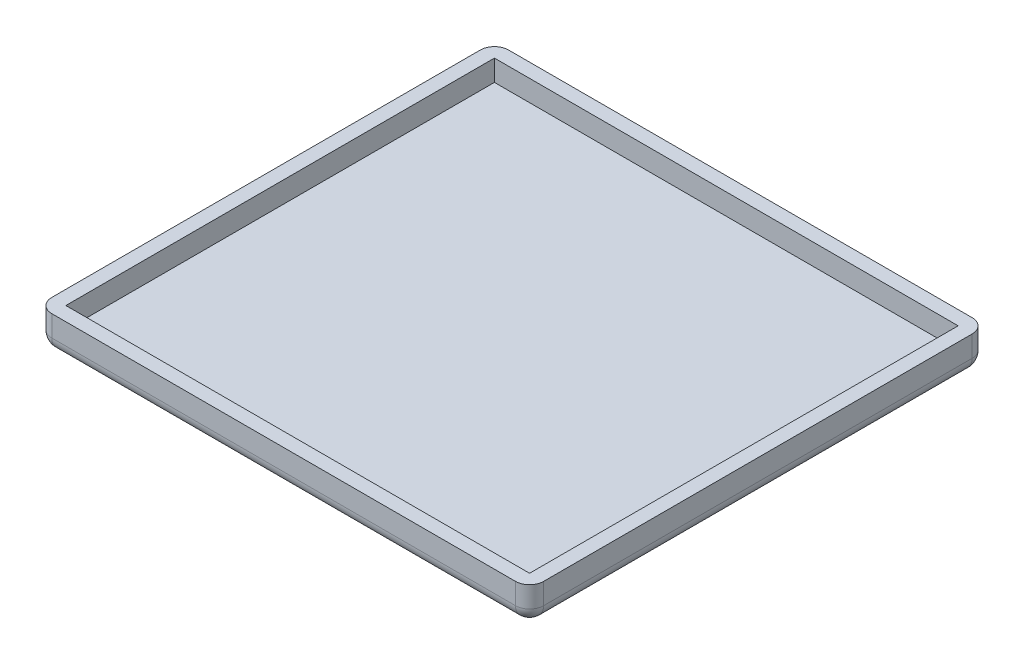
ISO-10303-21;
HEADER;
FILE_DESCRIPTION(('STEP AP214'),'2;1');
FILE_NAME('part.step','',(''),(''),'','','');
FILE_SCHEMA(('AUTOMOTIVE_DESIGN { 1 0 10303 214 1 1 1 1 }'));
ENDSEC;
DATA;
#1=APPLICATION_CONTEXT('core data for automotive mechanical design processes');
#2=APPLICATION_PROTOCOL_DEFINITION('international standard','automotive_design',2000,#1);
#3=PRODUCT_CONTEXT('',#1,'mechanical');
#4=PRODUCT('Part','Part','',(#3));
#5=PRODUCT_RELATED_PRODUCT_CATEGORY('part','',(#4));
#6=PRODUCT_DEFINITION_FORMATION('','',#4);
#7=PRODUCT_DEFINITION_CONTEXT('part definition',#1,'design');
#8=PRODUCT_DEFINITION('design','',#6,#7);
#9=PRODUCT_DEFINITION_SHAPE('','',#8);
#10=(LENGTH_UNIT() NAMED_UNIT(*) SI_UNIT(.MILLI.,.METRE.));
#11=(NAMED_UNIT(*) PLANE_ANGLE_UNIT() SI_UNIT($,.RADIAN.));
#12=(NAMED_UNIT(*) SI_UNIT($,.STERADIAN.) SOLID_ANGLE_UNIT());
#13=UNCERTAINTY_MEASURE_WITH_UNIT(LENGTH_MEASURE(1.E-05),#10,'distance_accuracy_value','');
#14=(GEOMETRIC_REPRESENTATION_CONTEXT(3) GLOBAL_UNCERTAINTY_ASSIGNED_CONTEXT((#13)) GLOBAL_UNIT_ASSIGNED_CONTEXT((#10,
#11,#12)) REPRESENTATION_CONTEXT('',''));
#15=CARTESIAN_POINT('',(0.,0.,0.));
#16=DIRECTION('',(0.,0.,1.));
#17=DIRECTION('',(1.,0.,0.));
#18=AXIS2_PLACEMENT_3D('',#15,#16,#17);
#19=CARTESIAN_POINT('',(-33.,5.,-30.5));
#20=DIRECTION('',(1.,0.,0.));
#21=DIRECTION('',(0.,0.,-1.));
#22=AXIS2_PLACEMENT_3D('',#19,#20,#21);
#23=PLANE('',#22);
#24=DIRECTION('',(0.,-1.,0.));
#25=VECTOR('',#24,1.);
#26=CARTESIAN_POINT('',(-33.,5.,30.5));
#27=LINE('',#26,#25);
#28=CARTESIAN_POINT('',(-33.,5.,30.5));
#29=VERTEX_POINT('',#28);
#30=CARTESIAN_POINT('',(-33.,2.,30.5));
#31=VERTEX_POINT('',#30);
#32=EDGE_CURVE('E156',#29,#31,#27,.T.);
#33=ORIENTED_EDGE('',*,*,#32,.T.);
#34=DIRECTION('',(0.,0.,1.));
#35=VECTOR('',#34,1.);
#36=CARTESIAN_POINT('',(-33.,2.,30.5));
#37=LINE('',#36,#35);
#38=CARTESIAN_POINT('',(-33.,2.,-30.5));
#39=VERTEX_POINT('',#38);
#40=EDGE_CURVE('E139',#39,#31,#37,.T.);
#41=ORIENTED_EDGE('',*,*,#40,.F.);
#42=DIRECTION('',(0.,-1.,0.));
#43=VECTOR('',#42,1.);
#44=CARTESIAN_POINT('',(-33.,5.,-30.5));
#45=LINE('',#44,#43);
#46=CARTESIAN_POINT('',(-33.,5.,-30.5));
#47=VERTEX_POINT('',#46);
#48=EDGE_CURVE('E541',#47,#39,#45,.T.);
#49=ORIENTED_EDGE('',*,*,#48,.F.);
#50=DIRECTION('',(0.,0.,1.));
#51=VECTOR('',#50,1.);
#52=CARTESIAN_POINT('',(-33.,5.,-30.5));
#53=LINE('',#52,#51);
#54=EDGE_CURVE('E164',#47,#29,#53,.T.);
#55=ORIENTED_EDGE('',*,*,#54,.T.);
#56=EDGE_LOOP('',(#33,#41,#49,#55));
#57=FACE_BOUND('',#56,.T.);
#58=ADVANCED_FACE('F39',(#57),#23,.T.);
#59=CARTESIAN_POINT('',(-33.,5.,30.5));
#60=DIRECTION('',(0.,0.,-1.));
#61=DIRECTION('',(-1.,0.,0.));
#62=AXIS2_PLACEMENT_3D('',#59,#60,#61);
#63=PLANE('',#62);
#64=DIRECTION('',(0.,-1.,0.));
#65=VECTOR('',#64,1.);
#66=CARTESIAN_POINT('',(33.,5.,30.5));
#67=LINE('',#66,#65);
#68=CARTESIAN_POINT('',(33.,5.,30.5));
#69=VERTEX_POINT('',#68);
#70=CARTESIAN_POINT('',(33.,2.,30.5));
#71=VERTEX_POINT('',#70);
#72=EDGE_CURVE('E159',#69,#71,#67,.T.);
#73=ORIENTED_EDGE('',*,*,#72,.T.);
#74=DIRECTION('',(1.,0.,0.));
#75=VECTOR('',#74,1.);
#76=CARTESIAN_POINT('',(33.,2.,30.5));
#77=LINE('',#76,#75);
#78=EDGE_CURVE('E142',#31,#71,#77,.T.);
#79=ORIENTED_EDGE('',*,*,#78,.F.);
#80=ORIENTED_EDGE('',*,*,#32,.F.);
#81=DIRECTION('',(1.,0.,0.));
#82=VECTOR('',#81,1.);
#83=CARTESIAN_POINT('',(-33.,5.,30.5));
#84=LINE('',#83,#82);
#85=EDGE_CURVE('E555',#29,#69,#84,.T.);
#86=ORIENTED_EDGE('',*,*,#85,.T.);
#87=EDGE_LOOP('',(#73,#79,#80,#86));
#88=FACE_BOUND('',#87,.T.);
#89=ADVANCED_FACE('F155',(#88),#63,.T.);
#90=CARTESIAN_POINT('',(33.,5.,-30.5));
#91=DIRECTION('',(-1.,0.,0.));
#92=DIRECTION('',(0.,0.,1.));
#93=AXIS2_PLACEMENT_3D('',#90,#91,#92);
#94=PLANE('',#93);
#95=DIRECTION('',(0.,-1.,0.));
#96=VECTOR('',#95,1.);
#97=CARTESIAN_POINT('',(33.,5.,-30.5));
#98=LINE('',#97,#96);
#99=CARTESIAN_POINT('',(33.,5.,-30.5));
#100=VERTEX_POINT('',#99);
#101=CARTESIAN_POINT('',(33.,2.,-30.5));
#102=VERTEX_POINT('',#101);
#103=EDGE_CURVE('E173',#100,#102,#98,.T.);
#104=ORIENTED_EDGE('',*,*,#103,.T.);
#105=DIRECTION('',(0.,0.,-1.));
#106=VECTOR('',#105,1.);
#107=CARTESIAN_POINT('',(33.,2.,-30.5));
#108=LINE('',#107,#106);
#109=EDGE_CURVE('E161',#71,#102,#108,.T.);
#110=ORIENTED_EDGE('',*,*,#109,.F.);
#111=ORIENTED_EDGE('',*,*,#72,.F.);
#112=DIRECTION('',(0.,0.,-1.));
#113=VECTOR('',#112,1.);
#114=CARTESIAN_POINT('',(33.,5.,-30.5));
#115=LINE('',#114,#113);
#116=EDGE_CURVE('E549',#69,#100,#115,.T.);
#117=ORIENTED_EDGE('',*,*,#116,.T.);
#118=EDGE_LOOP('',(#104,#110,#111,#117));
#119=FACE_BOUND('',#118,.T.);
#120=ADVANCED_FACE('F356',(#119),#94,.T.);
#121=CARTESIAN_POINT('',(-33.,5.,-30.5));
#122=DIRECTION('',(0.,0.,1.));
#123=DIRECTION('',(1.,0.,0.));
#124=AXIS2_PLACEMENT_3D('',#121,#122,#123);
#125=PLANE('',#124);
#126=ORIENTED_EDGE('',*,*,#48,.T.);
#127=DIRECTION('',(-1.,0.,0.));
#128=VECTOR('',#127,1.);
#129=CARTESIAN_POINT('',(-33.,2.,-30.5));
#130=LINE('',#129,#128);
#131=EDGE_CURVE('E145',#102,#39,#130,.T.);
#132=ORIENTED_EDGE('',*,*,#131,.F.);
#133=ORIENTED_EDGE('',*,*,#103,.F.);
#134=DIRECTION('',(-1.,0.,0.));
#135=VECTOR('',#134,1.);
#136=CARTESIAN_POINT('',(-33.,5.,-30.5));
#137=LINE('',#136,#135);
#138=EDGE_CURVE('E544',#100,#47,#137,.T.);
#139=ORIENTED_EDGE('',*,*,#138,.T.);
#140=EDGE_LOOP('',(#126,#132,#133,#139));
#141=FACE_BOUND('',#140,.T.);
#142=ADVANCED_FACE('F362',(#141),#125,.T.);
#143=CARTESIAN_POINT('',(0.,5.,0.));
#144=DIRECTION('',(0.,1.,0.));
#145=DIRECTION('',(0.,0.,1.));
#146=AXIS2_PLACEMENT_3D('',#143,#144,#145);
#147=PLANE('',#146);
#148=DIRECTION('',(-1.,0.,0.));
#149=VECTOR('',#148,1.);
#150=CARTESIAN_POINT('',(-35.,5.,-32.5));
#151=LINE('',#150,#149);
#152=CARTESIAN_POINT('',(33.,5.,-32.5));
#153=VERTEX_POINT('',#152);
#154=CARTESIAN_POINT('',(-33.,5.,-32.5));
#155=VERTEX_POINT('',#154);
#156=EDGE_CURVE('E171',#153,#155,#151,.T.);
#157=ORIENTED_EDGE('',*,*,#156,.T.);
#158=CARTESIAN_POINT('',(-33.,5.,-30.5));
#159=DIRECTION('',(0.,1.,0.));
#160=DIRECTION('',(0.,0.,1.));
#161=AXIS2_PLACEMENT_3D('',#158,#159,#160);
#162=CIRCLE('',#161,2.);
#163=CARTESIAN_POINT('',(-35.,5.,-30.5));
#164=VERTEX_POINT('',#163);
#165=EDGE_CURVE('E229',#155,#164,#162,.T.);
#166=ORIENTED_EDGE('',*,*,#165,.T.);
#167=DIRECTION('',(0.,0.,1.));
#168=VECTOR('',#167,1.);
#169=CARTESIAN_POINT('',(-35.,5.,-32.5));
#170=LINE('',#169,#168);
#171=CARTESIAN_POINT('',(-35.,5.,30.5));
#172=VERTEX_POINT('',#171);
#173=EDGE_CURVE('E180',#164,#172,#170,.T.);
#174=ORIENTED_EDGE('',*,*,#173,.T.);
#175=CARTESIAN_POINT('',(-33.,5.,30.5));
#176=DIRECTION('',(0.,1.,0.));
#177=DIRECTION('',(0.,0.,1.));
#178=AXIS2_PLACEMENT_3D('',#175,#176,#177);
#179=CIRCLE('',#178,2.);
#180=CARTESIAN_POINT('',(-33.,5.,32.5));
#181=VERTEX_POINT('',#180);
#182=EDGE_CURVE('E220',#172,#181,#179,.T.);
#183=ORIENTED_EDGE('',*,*,#182,.T.);
#184=DIRECTION('',(1.,0.,0.));
#185=VECTOR('',#184,1.);
#186=CARTESIAN_POINT('',(-35.,5.,32.5));
#187=LINE('',#186,#185);
#188=CARTESIAN_POINT('',(33.,5.,32.5));
#189=VERTEX_POINT('',#188);
#190=EDGE_CURVE('E184',#181,#189,#187,.T.);
#191=ORIENTED_EDGE('',*,*,#190,.T.);
#192=CARTESIAN_POINT('',(33.,5.,30.5));
#193=DIRECTION('',(0.,1.,0.));
#194=DIRECTION('',(0.,0.,1.));
#195=AXIS2_PLACEMENT_3D('',#192,#193,#194);
#196=CIRCLE('',#195,2.);
#197=CARTESIAN_POINT('',(35.,5.,30.5));
#198=VERTEX_POINT('',#197);
#199=EDGE_CURVE('E223',#189,#198,#196,.T.);
#200=ORIENTED_EDGE('',*,*,#199,.T.);
#201=DIRECTION('',(0.,0.,-1.));
#202=VECTOR('',#201,1.);
#203=CARTESIAN_POINT('',(35.,5.,-32.5));
#204=LINE('',#203,#202);
#205=CARTESIAN_POINT('',(35.,5.,-30.5));
#206=VERTEX_POINT('',#205);
#207=EDGE_CURVE('E166',#198,#206,#204,.T.);
#208=ORIENTED_EDGE('',*,*,#207,.T.);
#209=CARTESIAN_POINT('',(33.,5.,-30.5));
#210=DIRECTION('',(0.,1.,0.));
#211=DIRECTION('',(0.,0.,1.));
#212=AXIS2_PLACEMENT_3D('',#209,#210,#211);
#213=CIRCLE('',#212,2.);
#214=EDGE_CURVE('E226',#206,#153,#213,.T.);
#215=ORIENTED_EDGE('',*,*,#214,.T.);
#216=EDGE_LOOP('',(#157,#166,#174,#183,#191,#200,#208,#215));
#217=FACE_BOUND('',#216,.T.);
#218=ORIENTED_EDGE('',*,*,#85,.F.);
#219=ORIENTED_EDGE('',*,*,#54,.F.);
#220=ORIENTED_EDGE('',*,*,#138,.F.);
#221=ORIENTED_EDGE('',*,*,#116,.F.);
#222=EDGE_LOOP('',(#218,#219,#220,#221));
#223=FACE_BOUND('',#222,.T.);
#224=ADVANCED_FACE('F312',(#217,#223),#147,.T.);
#225=CARTESIAN_POINT('',(0.,0.,0.));
#226=DIRECTION('',(0.,1.,0.));
#227=DIRECTION('',(0.,0.,1.));
#228=AXIS2_PLACEMENT_3D('',#225,#226,#227);
#229=PLANE('',#228);
#230=DIRECTION('',(0.,0.,1.));
#231=VECTOR('',#230,1.);
#232=CARTESIAN_POINT('',(-33.,0.,0.));
#233=LINE('',#232,#231);
#234=CARTESIAN_POINT('',(-33.,0.,30.5));
#235=VERTEX_POINT('',#234);
#236=CARTESIAN_POINT('',(-33.,0.,-30.5));
#237=VERTEX_POINT('',#236);
#238=EDGE_CURVE('E198',#235,#237,#233,.F.);
#239=ORIENTED_EDGE('',*,*,#238,.T.);
#240=DIRECTION('',(-1.,0.,0.));
#241=VECTOR('',#240,1.);
#242=CARTESIAN_POINT('',(0.,0.,-30.5));
#243=LINE('',#242,#241);
#244=CARTESIAN_POINT('',(33.,0.,-30.5));
#245=VERTEX_POINT('',#244);
#246=EDGE_CURVE('E207',#237,#245,#243,.F.);
#247=ORIENTED_EDGE('',*,*,#246,.T.);
#248=DIRECTION('',(0.,0.,-1.));
#249=VECTOR('',#248,1.);
#250=CARTESIAN_POINT('',(33.,0.,0.));
#251=LINE('',#250,#249);
#252=CARTESIAN_POINT('',(33.,0.,30.5));
#253=VERTEX_POINT('',#252);
#254=EDGE_CURVE('E204',#245,#253,#251,.F.);
#255=ORIENTED_EDGE('',*,*,#254,.T.);
#256=DIRECTION('',(1.,0.,0.));
#257=VECTOR('',#256,1.);
#258=CARTESIAN_POINT('',(0.,0.,30.5));
#259=LINE('',#258,#257);
#260=EDGE_CURVE('E201',#253,#235,#259,.F.);
#261=ORIENTED_EDGE('',*,*,#260,.T.);
#262=EDGE_LOOP('',(#239,#247,#255,#261));
#263=FACE_BOUND('',#262,.T.);
#264=ADVANCED_FACE('F342',(#263),#229,.F.);
#265=CARTESIAN_POINT('',(35.,5.,-32.5));
#266=DIRECTION('',(-1.,0.,0.));
#267=DIRECTION('',(0.,0.,1.));
#268=AXIS2_PLACEMENT_3D('',#265,#266,#267);
#269=PLANE('',#268);
#270=DIRECTION('',(0.,0.,-1.));
#271=VECTOR('',#270,1.);
#272=CARTESIAN_POINT('',(35.,2.,-32.5));
#273=LINE('',#272,#271);
#274=CARTESIAN_POINT('',(35.,2.,30.5));
#275=VERTEX_POINT('',#274);
#276=CARTESIAN_POINT('',(35.,2.,-30.5));
#277=VERTEX_POINT('',#276);
#278=EDGE_CURVE('E235',#275,#277,#273,.T.);
#279=ORIENTED_EDGE('',*,*,#278,.T.);
#280=DIRECTION('',(0.,-1.,0.));
#281=VECTOR('',#280,1.);
#282=CARTESIAN_POINT('',(35.,5.,-30.5));
#283=LINE('',#282,#281);
#284=EDGE_CURVE('E238',#277,#206,#283,.F.);
#285=ORIENTED_EDGE('',*,*,#284,.T.);
#286=ORIENTED_EDGE('',*,*,#207,.F.);
#287=DIRECTION('',(0.,-1.,0.));
#288=VECTOR('',#287,1.);
#289=CARTESIAN_POINT('',(35.,5.,30.5));
#290=LINE('',#289,#288);
#291=EDGE_CURVE('E232',#198,#275,#290,.T.);
#292=ORIENTED_EDGE('',*,*,#291,.T.);
#293=EDGE_LOOP('',(#279,#285,#286,#292));
#294=FACE_BOUND('',#293,.T.);
#295=ADVANCED_FACE('F301',(#294),#269,.F.);
#296=CARTESIAN_POINT('',(-35.,5.,-32.5));
#297=DIRECTION('',(0.,0.,1.));
#298=DIRECTION('',(1.,0.,0.));
#299=AXIS2_PLACEMENT_3D('',#296,#297,#298);
#300=PLANE('',#299);
#301=DIRECTION('',(-1.,0.,0.));
#302=VECTOR('',#301,1.);
#303=CARTESIAN_POINT('',(-35.,2.,-32.5));
#304=LINE('',#303,#302);
#305=CARTESIAN_POINT('',(33.,2.,-32.5));
#306=VERTEX_POINT('',#305);
#307=CARTESIAN_POINT('',(-33.,2.,-32.5));
#308=VERTEX_POINT('',#307);
#309=EDGE_CURVE('E191',#306,#308,#304,.T.);
#310=ORIENTED_EDGE('',*,*,#309,.T.);
#311=DIRECTION('',(0.,-1.,0.));
#312=VECTOR('',#311,1.);
#313=CARTESIAN_POINT('',(-33.,5.,-32.5));
#314=LINE('',#313,#312);
#315=EDGE_CURVE('E195',#308,#155,#314,.F.);
#316=ORIENTED_EDGE('',*,*,#315,.T.);
#317=ORIENTED_EDGE('',*,*,#156,.F.);
#318=DIRECTION('',(0.,-1.,0.));
#319=VECTOR('',#318,1.);
#320=CARTESIAN_POINT('',(33.,5.,-32.5));
#321=LINE('',#320,#319);
#322=EDGE_CURVE('E188',#153,#306,#321,.T.);
#323=ORIENTED_EDGE('',*,*,#322,.T.);
#324=EDGE_LOOP('',(#310,#316,#317,#323));
#325=FACE_BOUND('',#324,.T.);
#326=ADVANCED_FACE('F316',(#325),#300,.F.);
#327=CARTESIAN_POINT('',(-35.,5.,-32.5));
#328=DIRECTION('',(1.,0.,0.));
#329=DIRECTION('',(0.,0.,-1.));
#330=AXIS2_PLACEMENT_3D('',#327,#328,#329);
#331=PLANE('',#330);
#332=ORIENTED_EDGE('',*,*,#173,.F.);
#333=DIRECTION('',(0.,-1.,0.));
#334=VECTOR('',#333,1.);
#335=CARTESIAN_POINT('',(-35.,5.,-30.5));
#336=LINE('',#335,#334);
#337=CARTESIAN_POINT('',(-35.,2.,-30.5));
#338=VERTEX_POINT('',#337);
#339=EDGE_CURVE('E217',#164,#338,#336,.T.);
#340=ORIENTED_EDGE('',*,*,#339,.T.);
#341=DIRECTION('',(0.,0.,1.));
#342=VECTOR('',#341,1.);
#343=CARTESIAN_POINT('',(-35.,2.,-32.5));
#344=LINE('',#343,#342);
#345=CARTESIAN_POINT('',(-35.,2.,30.5));
#346=VERTEX_POINT('',#345);
#347=EDGE_CURVE('E211',#338,#346,#344,.T.);
#348=ORIENTED_EDGE('',*,*,#347,.T.);
#349=DIRECTION('',(0.,-1.,0.));
#350=VECTOR('',#349,1.);
#351=CARTESIAN_POINT('',(-35.,5.,30.5));
#352=LINE('',#351,#350);
#353=EDGE_CURVE('E214',#346,#172,#352,.F.);
#354=ORIENTED_EDGE('',*,*,#353,.T.);
#355=EDGE_LOOP('',(#332,#340,#348,#354));
#356=FACE_BOUND('',#355,.T.);
#357=ADVANCED_FACE('F326',(#356),#331,.F.);
#358=CARTESIAN_POINT('',(-35.,5.,32.5));
#359=DIRECTION('',(0.,0.,-1.));
#360=DIRECTION('',(-1.,0.,0.));
#361=AXIS2_PLACEMENT_3D('',#358,#359,#360);
#362=PLANE('',#361);
#363=DIRECTION('',(1.,0.,0.));
#364=VECTOR('',#363,1.);
#365=CARTESIAN_POINT('',(-35.,2.,32.5));
#366=LINE('',#365,#364);
#367=CARTESIAN_POINT('',(-33.,2.,32.5));
#368=VERTEX_POINT('',#367);
#369=CARTESIAN_POINT('',(33.,2.,32.5));
#370=VERTEX_POINT('',#369);
#371=EDGE_CURVE('E49',#368,#370,#366,.T.);
#372=ORIENTED_EDGE('',*,*,#371,.T.);
#373=DIRECTION('',(0.,-1.,0.));
#374=VECTOR('',#373,1.);
#375=CARTESIAN_POINT('',(33.,5.,32.5));
#376=LINE('',#375,#374);
#377=EDGE_CURVE('E11',#370,#189,#376,.F.);
#378=ORIENTED_EDGE('',*,*,#377,.T.);
#379=ORIENTED_EDGE('',*,*,#190,.F.);
#380=DIRECTION('',(0.,-1.,0.));
#381=VECTOR('',#380,1.);
#382=CARTESIAN_POINT('',(-33.,5.,32.5));
#383=LINE('',#382,#381);
#384=EDGE_CURVE('E60',#181,#368,#383,.T.);
#385=ORIENTED_EDGE('',*,*,#384,.T.);
#386=EDGE_LOOP('',(#372,#378,#379,#385));
#387=FACE_BOUND('',#386,.T.);
#388=ADVANCED_FACE('F365',(#387),#362,.F.);
#389=CARTESIAN_POINT('',(0.,2.,0.));
#390=DIRECTION('',(0.,-1.,0.));
#391=DIRECTION('',(0.,0.,-1.));
#392=AXIS2_PLACEMENT_3D('',#389,#390,#391);
#393=PLANE('',#392);
#394=ORIENTED_EDGE('',*,*,#40,.T.);
#395=ORIENTED_EDGE('',*,*,#78,.T.);
#396=ORIENTED_EDGE('',*,*,#109,.T.);
#397=ORIENTED_EDGE('',*,*,#131,.T.);
#398=EDGE_LOOP('',(#394,#395,#396,#397));
#399=FACE_BOUND('',#398,.T.);
#400=ADVANCED_FACE('F141',(#399),#393,.F.);
#401=CARTESIAN_POINT('',(33.,5.,30.5));
#402=DIRECTION('',(0.,-1.,0.));
#403=DIRECTION('',(0.,0.,-1.));
#404=AXIS2_PLACEMENT_3D('',#401,#402,#403);
#405=CYLINDRICAL_SURFACE('',#404,2.);
#406=ORIENTED_EDGE('',*,*,#199,.F.);
#407=ORIENTED_EDGE('',*,*,#377,.F.);
#408=CARTESIAN_POINT('',(33.,2.,30.5));
#409=DIRECTION('',(0.,-1.,0.));
#410=DIRECTION('',(0.,0.,-1.));
#411=AXIS2_PLACEMENT_3D('',#408,#409,#410);
#412=CIRCLE('',#411,2.);
#413=EDGE_CURVE('E282',#275,#370,#412,.T.);
#414=ORIENTED_EDGE('',*,*,#413,.F.);
#415=ORIENTED_EDGE('',*,*,#291,.F.);
#416=EDGE_LOOP('',(#406,#407,#414,#415));
#417=FACE_BOUND('',#416,.T.);
#418=ADVANCED_FACE('F41',(#417),#405,.T.);
#419=CARTESIAN_POINT('',(-33.,5.,30.5));
#420=DIRECTION('',(0.,-1.,0.));
#421=DIRECTION('',(0.,0.,-1.));
#422=AXIS2_PLACEMENT_3D('',#419,#420,#421);
#423=CYLINDRICAL_SURFACE('',#422,2.);
#424=ORIENTED_EDGE('',*,*,#182,.F.);
#425=ORIENTED_EDGE('',*,*,#353,.F.);
#426=CARTESIAN_POINT('',(-33.,2.,30.5));
#427=DIRECTION('',(0.,-1.,0.));
#428=DIRECTION('',(0.,0.,-1.));
#429=AXIS2_PLACEMENT_3D('',#426,#427,#428);
#430=CIRCLE('',#429,2.);
#431=EDGE_CURVE('E279',#368,#346,#430,.T.);
#432=ORIENTED_EDGE('',*,*,#431,.F.);
#433=ORIENTED_EDGE('',*,*,#384,.F.);
#434=EDGE_LOOP('',(#424,#425,#432,#433));
#435=FACE_BOUND('',#434,.T.);
#436=ADVANCED_FACE('F331',(#435),#423,.T.);
#437=CARTESIAN_POINT('',(-35.,2.,30.5));
#438=DIRECTION('',(1.,0.,0.));
#439=DIRECTION('',(0.,0.,-1.));
#440=AXIS2_PLACEMENT_3D('',#437,#438,#439);
#441=CYLINDRICAL_SURFACE('',#440,2.);
#442=CARTESIAN_POINT('',(33.,2.,30.5));
#443=DIRECTION('',(1.,0.,0.));
#444=DIRECTION('',(0.,0.,-1.));
#445=AXIS2_PLACEMENT_3D('',#442,#443,#444);
#446=CIRCLE('',#445,2.);
#447=EDGE_CURVE('E43',#370,#253,#446,.T.);
#448=ORIENTED_EDGE('',*,*,#447,.F.);
#449=ORIENTED_EDGE('',*,*,#371,.F.);
#450=CARTESIAN_POINT('',(-33.,2.,30.5));
#451=DIRECTION('',(-1.,0.,0.));
#452=DIRECTION('',(0.,0.,1.));
#453=AXIS2_PLACEMENT_3D('',#450,#451,#452);
#454=CIRCLE('',#453,2.);
#455=EDGE_CURVE('E275',#235,#368,#454,.T.);
#456=ORIENTED_EDGE('',*,*,#455,.F.);
#457=ORIENTED_EDGE('',*,*,#260,.F.);
#458=EDGE_LOOP('',(#448,#449,#456,#457));
#459=FACE_BOUND('',#458,.T.);
#460=ADVANCED_FACE('F343',(#459),#441,.T.);
#461=CARTESIAN_POINT('',(33.,2.,30.5));
#462=DIRECTION('',(0.,0.,1.));
#463=DIRECTION('',(1.,0.,0.));
#464=AXIS2_PLACEMENT_3D('',#461,#462,#463);
#465=SPHERICAL_SURFACE('',#464,2.);
#466=ORIENTED_EDGE('',*,*,#413,.T.);
#467=ORIENTED_EDGE('',*,*,#447,.T.);
#468=CARTESIAN_POINT('',(33.,2.,30.5));
#469=DIRECTION('',(0.,0.,1.));
#470=DIRECTION('',(1.,0.,0.));
#471=AXIS2_PLACEMENT_3D('',#468,#469,#470);
#472=CIRCLE('',#471,2.);
#473=EDGE_CURVE('E271',#275,#253,#472,.F.);
#474=ORIENTED_EDGE('',*,*,#473,.F.);
#475=EDGE_LOOP('',(#466,#467,#474));
#476=FACE_BOUND('',#475,.T.);
#477=ADVANCED_FACE('F291',(#476),#465,.T.);
#478=CARTESIAN_POINT('',(-33.,2.,30.5));
#479=DIRECTION('',(0.,0.,1.));
#480=DIRECTION('',(1.,0.,0.));
#481=AXIS2_PLACEMENT_3D('',#478,#479,#480);
#482=SPHERICAL_SURFACE('',#481,2.);
#483=ORIENTED_EDGE('',*,*,#455,.T.);
#484=ORIENTED_EDGE('',*,*,#431,.T.);
#485=CARTESIAN_POINT('',(-33.,2.,30.5));
#486=DIRECTION('',(0.,0.,1.));
#487=DIRECTION('',(1.,0.,0.));
#488=AXIS2_PLACEMENT_3D('',#485,#486,#487);
#489=CIRCLE('',#488,2.);
#490=EDGE_CURVE('E267',#235,#346,#489,.F.);
#491=ORIENTED_EDGE('',*,*,#490,.F.);
#492=EDGE_LOOP('',(#483,#484,#491));
#493=FACE_BOUND('',#492,.T.);
#494=ADVANCED_FACE('F334',(#493),#482,.T.);
#495=CARTESIAN_POINT('',(33.,2.,-32.5));
#496=DIRECTION('',(0.,0.,-1.));
#497=DIRECTION('',(-1.,0.,0.));
#498=AXIS2_PLACEMENT_3D('',#495,#496,#497);
#499=CYLINDRICAL_SURFACE('',#498,2.);
#500=ORIENTED_EDGE('',*,*,#473,.T.);
#501=ORIENTED_EDGE('',*,*,#254,.F.);
#502=CARTESIAN_POINT('',(33.,2.,-30.5));
#503=DIRECTION('',(0.,0.,-1.));
#504=DIRECTION('',(-1.,0.,0.));
#505=AXIS2_PLACEMENT_3D('',#502,#503,#504);
#506=CIRCLE('',#505,2.);
#507=EDGE_CURVE('E263',#277,#245,#506,.T.);
#508=ORIENTED_EDGE('',*,*,#507,.F.);
#509=ORIENTED_EDGE('',*,*,#278,.F.);
#510=EDGE_LOOP('',(#500,#501,#508,#509));
#511=FACE_BOUND('',#510,.T.);
#512=ADVANCED_FACE('F297',(#511),#499,.T.);
#513=CARTESIAN_POINT('',(33.,5.,-30.5));
#514=DIRECTION('',(0.,-1.,0.));
#515=DIRECTION('',(0.,0.,-1.));
#516=AXIS2_PLACEMENT_3D('',#513,#514,#515);
#517=CYLINDRICAL_SURFACE('',#516,2.);
#518=ORIENTED_EDGE('',*,*,#214,.F.);
#519=ORIENTED_EDGE('',*,*,#284,.F.);
#520=CARTESIAN_POINT('',(33.,2.,-30.5));
#521=DIRECTION('',(0.,-1.,0.));
#522=DIRECTION('',(0.,0.,-1.));
#523=AXIS2_PLACEMENT_3D('',#520,#521,#522);
#524=CIRCLE('',#523,2.);
#525=EDGE_CURVE('E259',#306,#277,#524,.T.);
#526=ORIENTED_EDGE('',*,*,#525,.F.);
#527=ORIENTED_EDGE('',*,*,#322,.F.);
#528=EDGE_LOOP('',(#518,#519,#526,#527));
#529=FACE_BOUND('',#528,.T.);
#530=ADVANCED_FACE('F307',(#529),#517,.T.);
#531=CARTESIAN_POINT('',(-33.,5.,-30.5));
#532=DIRECTION('',(0.,-1.,0.));
#533=DIRECTION('',(0.,0.,-1.));
#534=AXIS2_PLACEMENT_3D('',#531,#532,#533);
#535=CYLINDRICAL_SURFACE('',#534,2.);
#536=ORIENTED_EDGE('',*,*,#165,.F.);
#537=ORIENTED_EDGE('',*,*,#315,.F.);
#538=CARTESIAN_POINT('',(-33.,2.,-30.5));
#539=DIRECTION('',(0.,-1.,0.));
#540=DIRECTION('',(0.,0.,-1.));
#541=AXIS2_PLACEMENT_3D('',#538,#539,#540);
#542=CIRCLE('',#541,2.);
#543=EDGE_CURVE('E255',#338,#308,#542,.T.);
#544=ORIENTED_EDGE('',*,*,#543,.F.);
#545=ORIENTED_EDGE('',*,*,#339,.F.);
#546=EDGE_LOOP('',(#536,#537,#544,#545));
#547=FACE_BOUND('',#546,.T.);
#548=ADVANCED_FACE('F321',(#547),#535,.T.);
#549=CARTESIAN_POINT('',(-33.,2.,-32.5));
#550=DIRECTION('',(0.,0.,1.));
#551=DIRECTION('',(1.,0.,0.));
#552=AXIS2_PLACEMENT_3D('',#549,#550,#551);
#553=CYLINDRICAL_SURFACE('',#552,2.);
#554=ORIENTED_EDGE('',*,*,#490,.T.);
#555=ORIENTED_EDGE('',*,*,#347,.F.);
#556=CARTESIAN_POINT('',(-33.,2.,-30.5));
#557=DIRECTION('',(0.,0.,-1.));
#558=DIRECTION('',(-1.,0.,0.));
#559=AXIS2_PLACEMENT_3D('',#556,#557,#558);
#560=CIRCLE('',#559,2.);
#561=EDGE_CURVE('E251',#237,#338,#560,.T.);
#562=ORIENTED_EDGE('',*,*,#561,.F.);
#563=ORIENTED_EDGE('',*,*,#238,.F.);
#564=EDGE_LOOP('',(#554,#555,#562,#563));
#565=FACE_BOUND('',#564,.T.);
#566=ADVANCED_FACE('F338',(#565),#553,.T.);
#567=CARTESIAN_POINT('',(33.,2.,-30.5));
#568=DIRECTION('',(1.,0.,0.));
#569=DIRECTION('',(0.,0.,-1.));
#570=AXIS2_PLACEMENT_3D('',#567,#568,#569);
#571=SPHERICAL_SURFACE('',#570,2.);
#572=ORIENTED_EDGE('',*,*,#525,.T.);
#573=ORIENTED_EDGE('',*,*,#507,.T.);
#574=CARTESIAN_POINT('',(33.,2.,-30.5));
#575=DIRECTION('',(1.,0.,0.));
#576=DIRECTION('',(0.,0.,-1.));
#577=AXIS2_PLACEMENT_3D('',#574,#575,#576);
#578=CIRCLE('',#577,2.);
#579=EDGE_CURVE('E248',#306,#245,#578,.F.);
#580=ORIENTED_EDGE('',*,*,#579,.F.);
#581=EDGE_LOOP('',(#572,#573,#580));
#582=FACE_BOUND('',#581,.T.);
#583=ADVANCED_FACE('F381',(#582),#571,.T.);
#584=CARTESIAN_POINT('',(-33.,2.,-30.5));
#585=DIRECTION('',(-1.,0.,0.));
#586=DIRECTION('',(0.,0.,1.));
#587=AXIS2_PLACEMENT_3D('',#584,#585,#586);
#588=SPHERICAL_SURFACE('',#587,2.);
#589=ORIENTED_EDGE('',*,*,#561,.T.);
#590=ORIENTED_EDGE('',*,*,#543,.T.);
#591=CARTESIAN_POINT('',(-33.,2.,-30.5));
#592=DIRECTION('',(-1.,0.,0.));
#593=DIRECTION('',(0.,0.,1.));
#594=AXIS2_PLACEMENT_3D('',#591,#592,#593);
#595=CIRCLE('',#594,2.);
#596=EDGE_CURVE('E245',#237,#308,#595,.F.);
#597=ORIENTED_EDGE('',*,*,#596,.F.);
#598=EDGE_LOOP('',(#589,#590,#597));
#599=FACE_BOUND('',#598,.T.);
#600=ADVANCED_FACE('F377',(#599),#588,.T.);
#601=CARTESIAN_POINT('',(-35.,2.,-30.5));
#602=DIRECTION('',(-1.,0.,0.));
#603=DIRECTION('',(0.,0.,1.));
#604=AXIS2_PLACEMENT_3D('',#601,#602,#603);
#605=CYLINDRICAL_SURFACE('',#604,2.);
#606=ORIENTED_EDGE('',*,*,#579,.T.);
#607=ORIENTED_EDGE('',*,*,#246,.F.);
#608=ORIENTED_EDGE('',*,*,#596,.T.);
#609=ORIENTED_EDGE('',*,*,#309,.F.);
#610=EDGE_LOOP('',(#606,#607,#608,#609));
#611=FACE_BOUND('',#610,.T.);
#612=ADVANCED_FACE('F374',(#611),#605,.T.);
#613=CLOSED_SHELL('',(#58,#89,#120,#142,#224,#264,#295,#326,#357,#388,#400,#418,#436,#460,#477,
#494,#512,#530,#548,#566,#583,#600,#612));
#614=MANIFOLD_SOLID_BREP('B2',#613);
#615=ADVANCED_BREP_SHAPE_REPRESENTATION('',(#18,#614),#14);
#616=SHAPE_DEFINITION_REPRESENTATION(#9,#615);
ENDSEC;
END-ISO-10303-21;
